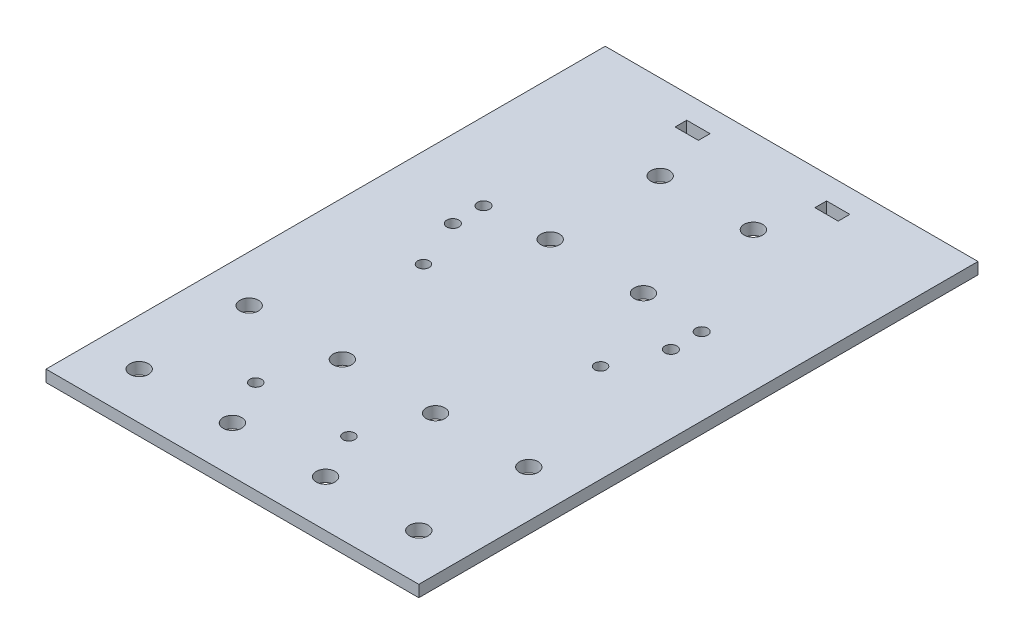
ISO-10303-21;
HEADER;
FILE_DESCRIPTION(('STEP AP214'),'2;1');
FILE_NAME('part.step','',(''),(''),'','','');
FILE_SCHEMA(('AUTOMOTIVE_DESIGN { 1 0 10303 214 1 1 1 1 }'));
ENDSEC;
DATA;
#1=APPLICATION_CONTEXT('core data for automotive mechanical design processes');
#2=APPLICATION_PROTOCOL_DEFINITION('international standard','automotive_design',2000,#1);
#3=PRODUCT_CONTEXT('',#1,'mechanical');
#4=PRODUCT('Part','Part','',(#3));
#5=PRODUCT_RELATED_PRODUCT_CATEGORY('part','',(#4));
#6=PRODUCT_DEFINITION_FORMATION('','',#4);
#7=PRODUCT_DEFINITION_CONTEXT('part definition',#1,'design');
#8=PRODUCT_DEFINITION('design','',#6,#7);
#9=PRODUCT_DEFINITION_SHAPE('','',#8);
#10=(LENGTH_UNIT() NAMED_UNIT(*) SI_UNIT(.MILLI.,.METRE.));
#11=(NAMED_UNIT(*) PLANE_ANGLE_UNIT() SI_UNIT($,.RADIAN.));
#12=(NAMED_UNIT(*) SI_UNIT($,.STERADIAN.) SOLID_ANGLE_UNIT());
#13=UNCERTAINTY_MEASURE_WITH_UNIT(LENGTH_MEASURE(1.E-05),#10,'distance_accuracy_value','');
#14=(GEOMETRIC_REPRESENTATION_CONTEXT(3) GLOBAL_UNCERTAINTY_ASSIGNED_CONTEXT((#13)) GLOBAL_UNIT_ASSIGNED_CONTEXT((#10,
#11,#12)) REPRESENTATION_CONTEXT('',''));
#15=CARTESIAN_POINT('',(0.,0.,0.));
#16=DIRECTION('',(0.,0.,1.));
#17=DIRECTION('',(1.,0.,0.));
#18=AXIS2_PLACEMENT_3D('',#15,#16,#17);
#19=CARTESIAN_POINT('',(50.8,3.175,76.2));
#20=DIRECTION('',(-1.,0.,0.));
#21=DIRECTION('',(0.,0.,1.));
#22=AXIS2_PLACEMENT_3D('',#19,#20,#21);
#23=PLANE('',#22);
#24=DIRECTION('',(0.,0.,-1.));
#25=VECTOR('',#24,1.);
#26=CARTESIAN_POINT('',(50.8,0.,76.2));
#27=LINE('',#26,#25);
#28=CARTESIAN_POINT('',(50.8,0.,76.2));
#29=VERTEX_POINT('',#28);
#30=CARTESIAN_POINT('',(50.8,0.,-76.2));
#31=VERTEX_POINT('',#30);
#32=EDGE_CURVE('E312',#29,#31,#27,.T.);
#33=ORIENTED_EDGE('',*,*,#32,.T.);
#34=DIRECTION('',(0.,-1.,0.));
#35=VECTOR('',#34,1.);
#36=CARTESIAN_POINT('',(50.8,3.175,-76.2));
#37=LINE('',#36,#35);
#38=CARTESIAN_POINT('',(50.8,3.175,-76.2));
#39=VERTEX_POINT('',#38);
#40=EDGE_CURVE('E11',#39,#31,#37,.T.);
#41=ORIENTED_EDGE('',*,*,#40,.F.);
#42=DIRECTION('',(0.,0.,-1.));
#43=VECTOR('',#42,1.);
#44=CARTESIAN_POINT('',(50.8,3.175,76.2));
#45=LINE('',#44,#43);
#46=CARTESIAN_POINT('',(50.8,3.175,76.2));
#47=VERTEX_POINT('',#46);
#48=EDGE_CURVE('E315',#47,#39,#45,.T.);
#49=ORIENTED_EDGE('',*,*,#48,.F.);
#50=DIRECTION('',(0.,-1.,0.));
#51=VECTOR('',#50,1.);
#52=CARTESIAN_POINT('',(50.8,3.175,76.2));
#53=LINE('',#52,#51);
#54=EDGE_CURVE('E325',#47,#29,#53,.T.);
#55=ORIENTED_EDGE('',*,*,#54,.T.);
#56=EDGE_LOOP('',(#33,#41,#49,#55));
#57=FACE_BOUND('',#56,.T.);
#58=ADVANCED_FACE('F37',(#57),#23,.F.);
#59=CARTESIAN_POINT('',(-50.8,3.175,-76.2));
#60=DIRECTION('',(0.,0.,1.));
#61=DIRECTION('',(1.,0.,0.));
#62=AXIS2_PLACEMENT_3D('',#59,#60,#61);
#63=PLANE('',#62);
#64=DIRECTION('',(-1.,0.,0.));
#65=VECTOR('',#64,1.);
#66=CARTESIAN_POINT('',(-50.8,0.,-76.2));
#67=LINE('',#66,#65);
#68=CARTESIAN_POINT('',(-50.8,0.,-76.2));
#69=VERTEX_POINT('',#68);
#70=EDGE_CURVE('E328',#31,#69,#67,.T.);
#71=ORIENTED_EDGE('',*,*,#70,.T.);
#72=DIRECTION('',(0.,-1.,0.));
#73=VECTOR('',#72,1.);
#74=CARTESIAN_POINT('',(-50.8,3.175,-76.2));
#75=LINE('',#74,#73);
#76=CARTESIAN_POINT('',(-50.8,3.175,-76.2));
#77=VERTEX_POINT('',#76);
#78=EDGE_CURVE('E44',#77,#69,#75,.T.);
#79=ORIENTED_EDGE('',*,*,#78,.F.);
#80=DIRECTION('',(-1.,0.,0.));
#81=VECTOR('',#80,1.);
#82=CARTESIAN_POINT('',(-50.8,3.175,-76.2));
#83=LINE('',#82,#81);
#84=EDGE_CURVE('E318',#39,#77,#83,.T.);
#85=ORIENTED_EDGE('',*,*,#84,.F.);
#86=ORIENTED_EDGE('',*,*,#40,.T.);
#87=EDGE_LOOP('',(#71,#79,#85,#86));
#88=FACE_BOUND('',#87,.T.);
#89=ADVANCED_FACE('F357',(#88),#63,.F.);
#90=CARTESIAN_POINT('',(-50.8,3.175,76.2));
#91=DIRECTION('',(1.,0.,0.));
#92=DIRECTION('',(0.,0.,-1.));
#93=AXIS2_PLACEMENT_3D('',#90,#91,#92);
#94=PLANE('',#93);
#95=DIRECTION('',(0.,0.,1.));
#96=VECTOR('',#95,1.);
#97=CARTESIAN_POINT('',(-50.8,0.,76.2));
#98=LINE('',#97,#96);
#99=CARTESIAN_POINT('',(-50.8,0.,76.2));
#100=VERTEX_POINT('',#99);
#101=EDGE_CURVE('E330',#69,#100,#98,.T.);
#102=ORIENTED_EDGE('',*,*,#101,.T.);
#103=DIRECTION('',(0.,-1.,0.));
#104=VECTOR('',#103,1.);
#105=CARTESIAN_POINT('',(-50.8,3.175,76.2));
#106=LINE('',#105,#104);
#107=CARTESIAN_POINT('',(-50.8,3.175,76.2));
#108=VERTEX_POINT('',#107);
#109=EDGE_CURVE('E335',#108,#100,#106,.T.);
#110=ORIENTED_EDGE('',*,*,#109,.F.);
#111=DIRECTION('',(0.,0.,1.));
#112=VECTOR('',#111,1.);
#113=CARTESIAN_POINT('',(-50.8,3.175,76.2));
#114=LINE('',#113,#112);
#115=EDGE_CURVE('E321',#77,#108,#114,.T.);
#116=ORIENTED_EDGE('',*,*,#115,.F.);
#117=ORIENTED_EDGE('',*,*,#78,.T.);
#118=EDGE_LOOP('',(#102,#110,#116,#117));
#119=FACE_BOUND('',#118,.T.);
#120=ADVANCED_FACE('F342',(#119),#94,.F.);
#121=CARTESIAN_POINT('',(-50.8,3.175,76.2));
#122=DIRECTION('',(0.,0.,-1.));
#123=DIRECTION('',(-1.,0.,0.));
#124=AXIS2_PLACEMENT_3D('',#121,#122,#123);
#125=PLANE('',#124);
#126=DIRECTION('',(1.,0.,0.));
#127=VECTOR('',#126,1.);
#128=CARTESIAN_POINT('',(-50.8,0.,76.2));
#129=LINE('',#128,#127);
#130=EDGE_CURVE('E319',#100,#29,#129,.T.);
#131=ORIENTED_EDGE('',*,*,#130,.T.);
#132=ORIENTED_EDGE('',*,*,#54,.F.);
#133=DIRECTION('',(1.,0.,0.));
#134=VECTOR('',#133,1.);
#135=CARTESIAN_POINT('',(-50.8,3.175,76.2));
#136=LINE('',#135,#134);
#137=EDGE_CURVE('E323',#108,#47,#136,.T.);
#138=ORIENTED_EDGE('',*,*,#137,.F.);
#139=ORIENTED_EDGE('',*,*,#109,.T.);
#140=EDGE_LOOP('',(#131,#132,#138,#139));
#141=FACE_BOUND('',#140,.T.);
#142=ADVANCED_FACE('F350',(#141),#125,.F.);
#143=CARTESIAN_POINT('',(0.,3.175,0.));
#144=DIRECTION('',(0.,-1.,0.));
#145=DIRECTION('',(0.,0.,-1.));
#146=AXIS2_PLACEMENT_3D('',#143,#144,#145);
#147=PLANE('',#146);
#148=DIRECTION('',(1.,0.,0.));
#149=VECTOR('',#148,1.);
#150=CARTESIAN_POINT('',(-22.225,3.175,-66.675));
#151=LINE('',#150,#149);
#152=CARTESIAN_POINT('',(-22.225,3.175,-66.675));
#153=VERTEX_POINT('',#152);
#154=CARTESIAN_POINT('',(-15.875,3.175,-66.675));
#155=VERTEX_POINT('',#154);
#156=EDGE_CURVE('E155',#153,#155,#151,.T.);
#157=ORIENTED_EDGE('',*,*,#156,.F.);
#158=DIRECTION('',(0.,0.,1.));
#159=VECTOR('',#158,1.);
#160=CARTESIAN_POINT('',(-22.225,3.175,-69.85));
#161=LINE('',#160,#159);
#162=CARTESIAN_POINT('',(-22.225,3.175,-69.85));
#163=VERTEX_POINT('',#162);
#164=EDGE_CURVE('E51',#163,#153,#161,.T.);
#165=ORIENTED_EDGE('',*,*,#164,.F.);
#166=DIRECTION('',(-1.,0.,0.));
#167=VECTOR('',#166,1.);
#168=CARTESIAN_POINT('',(-22.225,3.175,-69.85));
#169=LINE('',#168,#167);
#170=CARTESIAN_POINT('',(-15.875,3.175,-69.85));
#171=VERTEX_POINT('',#170);
#172=EDGE_CURVE('E146',#171,#163,#169,.T.);
#173=ORIENTED_EDGE('',*,*,#172,.F.);
#174=DIRECTION('',(0.,0.,-1.));
#175=VECTOR('',#174,1.);
#176=CARTESIAN_POINT('',(-15.875,3.175,-69.85));
#177=LINE('',#176,#175);
#178=EDGE_CURVE('E149',#155,#171,#177,.T.);
#179=ORIENTED_EDGE('',*,*,#178,.F.);
#180=EDGE_LOOP('',(#157,#165,#173,#179));
#181=FACE_BOUND('',#180,.T.);
#182=DIRECTION('',(-1.,0.,0.));
#183=VECTOR('',#182,1.);
#184=CARTESIAN_POINT('',(22.225,3.175,-69.85));
#185=LINE('',#184,#183);
#186=CARTESIAN_POINT('',(22.225,3.175,-69.85));
#187=VERTEX_POINT('',#186);
#188=CARTESIAN_POINT('',(15.875,3.175,-69.85));
#189=VERTEX_POINT('',#188);
#190=EDGE_CURVE('E181',#187,#189,#185,.T.);
#191=ORIENTED_EDGE('',*,*,#190,.F.);
#192=DIRECTION('',(0.,0.,-1.));
#193=VECTOR('',#192,1.);
#194=CARTESIAN_POINT('',(22.225,3.175,-69.85));
#195=LINE('',#194,#193);
#196=CARTESIAN_POINT('',(22.225,3.175,-66.675));
#197=VERTEX_POINT('',#196);
#198=EDGE_CURVE('E59',#197,#187,#195,.T.);
#199=ORIENTED_EDGE('',*,*,#198,.F.);
#200=DIRECTION('',(1.,0.,0.));
#201=VECTOR('',#200,1.);
#202=CARTESIAN_POINT('',(22.225,3.175,-66.675));
#203=LINE('',#202,#201);
#204=CARTESIAN_POINT('',(15.875,3.175,-66.675));
#205=VERTEX_POINT('',#204);
#206=EDGE_CURVE('E170',#205,#197,#203,.T.);
#207=ORIENTED_EDGE('',*,*,#206,.F.);
#208=DIRECTION('',(0.,0.,1.));
#209=VECTOR('',#208,1.);
#210=CARTESIAN_POINT('',(15.875,3.175,-69.85));
#211=LINE('',#210,#209);
#212=EDGE_CURVE('E184',#189,#205,#211,.T.);
#213=ORIENTED_EDGE('',*,*,#212,.F.);
#214=EDGE_LOOP('',(#191,#199,#207,#213));
#215=FACE_BOUND('',#214,.T.);
#216=CARTESIAN_POINT('',(-24.13,3.175,0.));
#217=DIRECTION('',(0.,1.,0.));
#218=DIRECTION('',(0.,0.,1.));
#219=AXIS2_PLACEMENT_3D('',#216,#217,#218);
#220=CIRCLE('',#219,1.5875);
#221=CARTESIAN_POINT('',(-24.13,3.175,1.5875));
#222=VERTEX_POINT('',#221);
#223=EDGE_CURVE('E199',#222,#222,#220,.T.);
#224=ORIENTED_EDGE('',*,*,#223,.F.);
#225=EDGE_LOOP('',(#224));
#226=FACE_BOUND('',#225,.T.);
#227=CARTESIAN_POINT('',(6.35000000000002,3.175,50.8));
#228=DIRECTION('',(0.,1.,0.));
#229=DIRECTION('',(0.,0.,1.));
#230=AXIS2_PLACEMENT_3D('',#227,#228,#229);
#231=CIRCLE('',#230,1.5875);
#232=CARTESIAN_POINT('',(6.35000000000002,3.175,52.3875));
#233=VERTEX_POINT('',#232);
#234=EDGE_CURVE('E162',#233,#233,#231,.T.);
#235=ORIENTED_EDGE('',*,*,#234,.F.);
#236=EDGE_LOOP('',(#235));
#237=FACE_BOUND('',#236,.T.);
#238=CARTESIAN_POINT('',(-19.05,3.175,50.8));
#239=DIRECTION('',(0.,1.,0.));
#240=DIRECTION('',(0.,0.,1.));
#241=AXIS2_PLACEMENT_3D('',#238,#239,#240);
#242=CIRCLE('',#241,1.5875);
#243=CARTESIAN_POINT('',(-19.05,3.175,52.3875));
#244=VERTEX_POINT('',#243);
#245=EDGE_CURVE('E206',#244,#244,#242,.T.);
#246=ORIENTED_EDGE('',*,*,#245,.F.);
#247=EDGE_LOOP('',(#246));
#248=FACE_BOUND('',#247,.T.);
#249=CARTESIAN_POINT('',(24.1299999999999,3.175,0.));
#250=DIRECTION('',(0.,1.,0.));
#251=DIRECTION('',(0.,0.,-1.));
#252=AXIS2_PLACEMENT_3D('',#249,#250,#251);
#253=CIRCLE('',#252,1.5875);
#254=CARTESIAN_POINT('',(24.1299999999999,3.175,-1.58750000000005));
#255=VERTEX_POINT('',#254);
#256=EDGE_CURVE('E211',#255,#255,#253,.T.);
#257=ORIENTED_EDGE('',*,*,#256,.F.);
#258=EDGE_LOOP('',(#257));
#259=FACE_BOUND('',#258,.T.);
#260=CARTESIAN_POINT('',(-29.718,3.175,-13.589));
#261=DIRECTION('',(0.,1.,0.));
#262=DIRECTION('',(0.,0.,-1.));
#263=AXIS2_PLACEMENT_3D('',#260,#261,#262);
#264=CIRCLE('',#263,1.65099999999999);
#265=CARTESIAN_POINT('',(-29.718,3.175,-15.24));
#266=VERTEX_POINT('',#265);
#267=EDGE_CURVE('E198',#266,#266,#264,.T.);
#268=ORIENTED_EDGE('',*,*,#267,.F.);
#269=EDGE_LOOP('',(#268));
#270=FACE_BOUND('',#269,.T.);
#271=CARTESIAN_POINT('',(-29.718,3.175,-21.971));
#272=DIRECTION('',(0.,1.,0.));
#273=DIRECTION('',(0.,0.,1.));
#274=AXIS2_PLACEMENT_3D('',#271,#272,#273);
#275=CIRCLE('',#274,1.651);
#276=CARTESIAN_POINT('',(-29.718,3.175,-20.32));
#277=VERTEX_POINT('',#276);
#278=EDGE_CURVE('E229',#277,#277,#275,.T.);
#279=ORIENTED_EDGE('',*,*,#278,.F.);
#280=EDGE_LOOP('',(#279));
#281=FACE_BOUND('',#280,.T.);
#282=CARTESIAN_POINT('',(29.718,3.175,-21.971));
#283=DIRECTION('',(0.,1.,0.));
#284=DIRECTION('',(0.,0.,-1.));
#285=AXIS2_PLACEMENT_3D('',#282,#283,#284);
#286=CIRCLE('',#285,1.651);
#287=CARTESIAN_POINT('',(29.718,3.175,-23.622));
#288=VERTEX_POINT('',#287);
#289=EDGE_CURVE('E223',#288,#288,#286,.T.);
#290=ORIENTED_EDGE('',*,*,#289,.F.);
#291=EDGE_LOOP('',(#290));
#292=FACE_BOUND('',#291,.T.);
#293=CARTESIAN_POINT('',(29.718,3.175,-13.589));
#294=DIRECTION('',(0.,1.,0.));
#295=DIRECTION('',(0.,0.,1.));
#296=AXIS2_PLACEMENT_3D('',#293,#294,#295);
#297=CIRCLE('',#296,1.651);
#298=CARTESIAN_POINT('',(29.718,3.175,-11.938));
#299=VERTEX_POINT('',#298);
#300=EDGE_CURVE('E222',#299,#299,#297,.T.);
#301=ORIENTED_EDGE('',*,*,#300,.F.);
#302=EDGE_LOOP('',(#301));
#303=FACE_BOUND('',#302,.T.);
#304=CARTESIAN_POINT('',(-12.7000000000001,3.175,33.528));
#305=DIRECTION('',(0.,1.,0.));
#306=DIRECTION('',(0.,0.,1.));
#307=AXIS2_PLACEMENT_3D('',#304,#305,#306);
#308=CIRCLE('',#307,2.54);
#309=CARTESIAN_POINT('',(-12.7000000000001,3.175,36.068));
#310=VERTEX_POINT('',#309);
#311=EDGE_CURVE('E277',#310,#310,#308,.T.);
#312=ORIENTED_EDGE('',*,*,#311,.F.);
#313=EDGE_LOOP('',(#312));
#314=FACE_BOUND('',#313,.T.);
#315=CARTESIAN_POINT('',(12.6999999999999,3.175,33.528));
#316=DIRECTION('',(0.,1.,0.));
#317=DIRECTION('',(0.,0.,1.));
#318=AXIS2_PLACEMENT_3D('',#315,#316,#317);
#319=CIRCLE('',#318,2.54);
#320=CARTESIAN_POINT('',(12.6999999999999,3.175,36.068));
#321=VERTEX_POINT('',#320);
#322=EDGE_CURVE('E264',#321,#321,#319,.T.);
#323=ORIENTED_EDGE('',*,*,#322,.F.);
#324=EDGE_LOOP('',(#323));
#325=FACE_BOUND('',#324,.T.);
#326=CARTESIAN_POINT('',(38.0999999999999,3.175,33.528));
#327=DIRECTION('',(0.,1.,0.));
#328=DIRECTION('',(0.,0.,1.));
#329=AXIS2_PLACEMENT_3D('',#326,#327,#328);
#330=CIRCLE('',#329,2.54);
#331=CARTESIAN_POINT('',(38.0999999999999,3.175,36.068));
#332=VERTEX_POINT('',#331);
#333=EDGE_CURVE('E265',#332,#332,#330,.T.);
#334=ORIENTED_EDGE('',*,*,#333,.F.);
#335=EDGE_LOOP('',(#334));
#336=FACE_BOUND('',#335,.T.);
#337=CARTESIAN_POINT('',(-12.7000000000003,3.175,-23.114));
#338=DIRECTION('',(0.,1.,0.));
#339=DIRECTION('',(0.,0.,1.));
#340=AXIS2_PLACEMENT_3D('',#337,#338,#339);
#341=CIRCLE('',#340,2.54);
#342=CARTESIAN_POINT('',(-12.7000000000003,3.175,-20.574));
#343=VERTEX_POINT('',#342);
#344=EDGE_CURVE('E252',#343,#343,#341,.T.);
#345=ORIENTED_EDGE('',*,*,#344,.F.);
#346=EDGE_LOOP('',(#345));
#347=FACE_BOUND('',#346,.T.);
#348=CARTESIAN_POINT('',(-12.7,3.175,63.5));
#349=DIRECTION('',(0.,1.,0.));
#350=DIRECTION('',(0.,0.,1.));
#351=AXIS2_PLACEMENT_3D('',#348,#349,#350);
#352=CIRCLE('',#351,2.54);
#353=CARTESIAN_POINT('',(-12.7,3.175,66.04));
#354=VERTEX_POINT('',#353);
#355=EDGE_CURVE('E301',#354,#354,#352,.T.);
#356=ORIENTED_EDGE('',*,*,#355,.F.);
#357=EDGE_LOOP('',(#356));
#358=FACE_BOUND('',#357,.T.);
#359=CARTESIAN_POINT('',(12.7,3.175,63.5));
#360=DIRECTION('',(0.,1.,0.));
#361=DIRECTION('',(0.,0.,1.));
#362=AXIS2_PLACEMENT_3D('',#359,#360,#361);
#363=CIRCLE('',#362,2.54);
#364=CARTESIAN_POINT('',(12.7,3.175,66.04));
#365=VERTEX_POINT('',#364);
#366=EDGE_CURVE('E288',#365,#365,#363,.T.);
#367=ORIENTED_EDGE('',*,*,#366,.F.);
#368=EDGE_LOOP('',(#367));
#369=FACE_BOUND('',#368,.T.);
#370=CARTESIAN_POINT('',(38.1,3.175,63.5));
#371=DIRECTION('',(0.,1.,0.));
#372=DIRECTION('',(0.,0.,1.));
#373=AXIS2_PLACEMENT_3D('',#370,#371,#372);
#374=CIRCLE('',#373,2.54);
#375=CARTESIAN_POINT('',(38.1,3.175,66.04));
#376=VERTEX_POINT('',#375);
#377=EDGE_CURVE('E289',#376,#376,#374,.T.);
#378=ORIENTED_EDGE('',*,*,#377,.F.);
#379=EDGE_LOOP('',(#378));
#380=FACE_BOUND('',#379,.T.);
#381=CARTESIAN_POINT('',(-38.1000000000001,3.175,33.528));
#382=DIRECTION('',(0.,1.,0.));
#383=DIRECTION('',(0.,0.,1.));
#384=AXIS2_PLACEMENT_3D('',#381,#382,#383);
#385=CIRCLE('',#384,2.54);
#386=CARTESIAN_POINT('',(-38.1000000000001,3.175,36.068));
#387=VERTEX_POINT('',#386);
#388=EDGE_CURVE('E276',#387,#387,#385,.T.);
#389=ORIENTED_EDGE('',*,*,#388,.F.);
#390=EDGE_LOOP('',(#389));
#391=FACE_BOUND('',#390,.T.);
#392=CARTESIAN_POINT('',(12.6999999999996,3.175,-53.086));
#393=DIRECTION('',(0.,1.,0.));
#394=DIRECTION('',(0.,0.,1.));
#395=AXIS2_PLACEMENT_3D('',#392,#393,#394);
#396=CIRCLE('',#395,2.54);
#397=CARTESIAN_POINT('',(12.6999999999996,3.175,-50.546));
#398=VERTEX_POINT('',#397);
#399=EDGE_CURVE('E240',#398,#398,#396,.T.);
#400=ORIENTED_EDGE('',*,*,#399,.F.);
#401=EDGE_LOOP('',(#400));
#402=FACE_BOUND('',#401,.T.);
#403=CARTESIAN_POINT('',(-12.7000000000004,3.175,-53.086));
#404=DIRECTION('',(0.,1.,0.));
#405=DIRECTION('',(0.,0.,1.));
#406=AXIS2_PLACEMENT_3D('',#403,#404,#405);
#407=CIRCLE('',#406,2.54);
#408=CARTESIAN_POINT('',(-12.7000000000004,3.175,-50.546));
#409=VERTEX_POINT('',#408);
#410=EDGE_CURVE('E246',#409,#409,#407,.T.);
#411=ORIENTED_EDGE('',*,*,#410,.F.);
#412=EDGE_LOOP('',(#411));
#413=FACE_BOUND('',#412,.T.);
#414=CARTESIAN_POINT('',(12.6999999999997,3.175,-23.114));
#415=DIRECTION('',(0.,1.,0.));
#416=DIRECTION('',(0.,0.,1.));
#417=AXIS2_PLACEMENT_3D('',#414,#415,#416);
#418=CIRCLE('',#417,2.54);
#419=CARTESIAN_POINT('',(12.6999999999997,3.175,-20.574));
#420=VERTEX_POINT('',#419);
#421=EDGE_CURVE('E253',#420,#420,#418,.T.);
#422=ORIENTED_EDGE('',*,*,#421,.F.);
#423=EDGE_LOOP('',(#422));
#424=FACE_BOUND('',#423,.T.);
#425=CARTESIAN_POINT('',(-38.1,3.175,63.5));
#426=DIRECTION('',(0.,1.,0.));
#427=DIRECTION('',(0.,0.,1.));
#428=AXIS2_PLACEMENT_3D('',#425,#426,#427);
#429=CIRCLE('',#428,2.54);
#430=CARTESIAN_POINT('',(-38.1,3.175,66.04));
#431=VERTEX_POINT('',#430);
#432=EDGE_CURVE('E300',#431,#431,#429,.T.);
#433=ORIENTED_EDGE('',*,*,#432,.F.);
#434=EDGE_LOOP('',(#433));
#435=FACE_BOUND('',#434,.T.);
#436=ORIENTED_EDGE('',*,*,#48,.T.);
#437=ORIENTED_EDGE('',*,*,#84,.T.);
#438=ORIENTED_EDGE('',*,*,#115,.T.);
#439=ORIENTED_EDGE('',*,*,#137,.T.);
#440=EDGE_LOOP('',(#436,#437,#438,#439));
#441=FACE_BOUND('',#440,.T.);
#442=ADVANCED_FACE('F356',(#181,#215,#226,#237,#248,#259,#270,#281,#292,#303,#314,#325,#336,
#347,#358,#369,#380,#391,#402,#413,#424,#435,#441),#147,.F.);
#443=CARTESIAN_POINT('',(0.,0.,0.));
#444=DIRECTION('',(0.,-1.,0.));
#445=DIRECTION('',(0.,0.,-1.));
#446=AXIS2_PLACEMENT_3D('',#443,#444,#445);
#447=PLANE('',#446);
#448=DIRECTION('',(0.,0.,1.));
#449=VECTOR('',#448,1.);
#450=CARTESIAN_POINT('',(-22.225,0.,-69.85));
#451=LINE('',#450,#449);
#452=CARTESIAN_POINT('',(-22.225,0.,-69.85));
#453=VERTEX_POINT('',#452);
#454=CARTESIAN_POINT('',(-22.225,0.,-66.675));
#455=VERTEX_POINT('',#454);
#456=EDGE_CURVE('E127',#453,#455,#451,.T.);
#457=ORIENTED_EDGE('',*,*,#456,.T.);
#458=DIRECTION('',(1.,0.,0.));
#459=VECTOR('',#458,1.);
#460=CARTESIAN_POINT('',(-22.225,0.,-66.675));
#461=LINE('',#460,#459);
#462=CARTESIAN_POINT('',(-15.875,0.,-66.675));
#463=VERTEX_POINT('',#462);
#464=EDGE_CURVE('E137',#455,#463,#461,.T.);
#465=ORIENTED_EDGE('',*,*,#464,.T.);
#466=DIRECTION('',(0.,0.,-1.));
#467=VECTOR('',#466,1.);
#468=CARTESIAN_POINT('',(-15.875,0.,-69.85));
#469=LINE('',#468,#467);
#470=CARTESIAN_POINT('',(-15.875,0.,-69.85));
#471=VERTEX_POINT('',#470);
#472=EDGE_CURVE('E141',#463,#471,#469,.T.);
#473=ORIENTED_EDGE('',*,*,#472,.T.);
#474=DIRECTION('',(-1.,0.,0.));
#475=VECTOR('',#474,1.);
#476=CARTESIAN_POINT('',(-22.225,0.,-69.85));
#477=LINE('',#476,#475);
#478=EDGE_CURVE('E133',#471,#453,#477,.T.);
#479=ORIENTED_EDGE('',*,*,#478,.T.);
#480=EDGE_LOOP('',(#457,#465,#473,#479));
#481=FACE_BOUND('',#480,.T.);
#482=DIRECTION('',(0.,0.,-1.));
#483=VECTOR('',#482,1.);
#484=CARTESIAN_POINT('',(22.225,0.,-69.85));
#485=LINE('',#484,#483);
#486=CARTESIAN_POINT('',(22.225,0.,-66.675));
#487=VERTEX_POINT('',#486);
#488=CARTESIAN_POINT('',(22.225,0.,-69.85));
#489=VERTEX_POINT('',#488);
#490=EDGE_CURVE('E166',#487,#489,#485,.T.);
#491=ORIENTED_EDGE('',*,*,#490,.T.);
#492=DIRECTION('',(-1.,0.,0.));
#493=VECTOR('',#492,1.);
#494=CARTESIAN_POINT('',(22.225,0.,-69.85));
#495=LINE('',#494,#493);
#496=CARTESIAN_POINT('',(15.875,0.,-69.85));
#497=VERTEX_POINT('',#496);
#498=EDGE_CURVE('E169',#489,#497,#495,.T.);
#499=ORIENTED_EDGE('',*,*,#498,.T.);
#500=DIRECTION('',(0.,0.,1.));
#501=VECTOR('',#500,1.);
#502=CARTESIAN_POINT('',(15.875,0.,-69.85));
#503=LINE('',#502,#501);
#504=CARTESIAN_POINT('',(15.875,0.,-66.675));
#505=VERTEX_POINT('',#504);
#506=EDGE_CURVE('E173',#497,#505,#503,.T.);
#507=ORIENTED_EDGE('',*,*,#506,.T.);
#508=DIRECTION('',(1.,0.,0.));
#509=VECTOR('',#508,1.);
#510=CARTESIAN_POINT('',(22.225,0.,-66.675));
#511=LINE('',#510,#509);
#512=EDGE_CURVE('E176',#505,#487,#511,.T.);
#513=ORIENTED_EDGE('',*,*,#512,.T.);
#514=EDGE_LOOP('',(#491,#499,#507,#513));
#515=FACE_BOUND('',#514,.T.);
#516=CARTESIAN_POINT('',(-24.13,0.,0.));
#517=DIRECTION('',(0.,1.,0.));
#518=DIRECTION('',(0.,0.,1.));
#519=AXIS2_PLACEMENT_3D('',#516,#517,#518);
#520=CIRCLE('',#519,1.5875);
#521=CARTESIAN_POINT('',(-24.13,0.,1.5875));
#522=VERTEX_POINT('',#521);
#523=EDGE_CURVE('E195',#522,#522,#520,.T.);
#524=ORIENTED_EDGE('',*,*,#523,.T.);
#525=EDGE_LOOP('',(#524));
#526=FACE_BOUND('',#525,.T.);
#527=CARTESIAN_POINT('',(6.35000000000002,0.,50.8));
#528=DIRECTION('',(0.,1.,0.));
#529=DIRECTION('',(0.,0.,1.));
#530=AXIS2_PLACEMENT_3D('',#527,#528,#529);
#531=CIRCLE('',#530,1.5875);
#532=CARTESIAN_POINT('',(6.35000000000002,0.,52.3875));
#533=VERTEX_POINT('',#532);
#534=EDGE_CURVE('E203',#533,#533,#531,.T.);
#535=ORIENTED_EDGE('',*,*,#534,.T.);
#536=EDGE_LOOP('',(#535));
#537=FACE_BOUND('',#536,.T.);
#538=CARTESIAN_POINT('',(-19.05,0.,50.8));
#539=DIRECTION('',(0.,1.,0.));
#540=DIRECTION('',(0.,0.,1.));
#541=AXIS2_PLACEMENT_3D('',#538,#539,#540);
#542=CIRCLE('',#541,1.5875);
#543=CARTESIAN_POINT('',(-19.05,0.,52.3875));
#544=VERTEX_POINT('',#543);
#545=EDGE_CURVE('E214',#544,#544,#542,.T.);
#546=ORIENTED_EDGE('',*,*,#545,.T.);
#547=EDGE_LOOP('',(#546));
#548=FACE_BOUND('',#547,.T.);
#549=CARTESIAN_POINT('',(24.1299999999999,0.,0.));
#550=DIRECTION('',(0.,1.,0.));
#551=DIRECTION('',(0.,0.,-1.));
#552=AXIS2_PLACEMENT_3D('',#549,#550,#551);
#553=CIRCLE('',#552,1.5875);
#554=CARTESIAN_POINT('',(24.1299999999999,0.,-1.58750000000005));
#555=VERTEX_POINT('',#554);
#556=EDGE_CURVE('E202',#555,#555,#553,.T.);
#557=ORIENTED_EDGE('',*,*,#556,.T.);
#558=EDGE_LOOP('',(#557));
#559=FACE_BOUND('',#558,.T.);
#560=CARTESIAN_POINT('',(-29.718,0.,-13.589));
#561=DIRECTION('',(0.,1.,0.));
#562=DIRECTION('',(0.,0.,-1.));
#563=AXIS2_PLACEMENT_3D('',#560,#561,#562);
#564=CIRCLE('',#563,1.65099999999999);
#565=CARTESIAN_POINT('',(-29.718,0.,-15.24));
#566=VERTEX_POINT('',#565);
#567=EDGE_CURVE('E232',#566,#566,#564,.T.);
#568=ORIENTED_EDGE('',*,*,#567,.T.);
#569=EDGE_LOOP('',(#568));
#570=FACE_BOUND('',#569,.T.);
#571=CARTESIAN_POINT('',(-29.718,0.,-21.971));
#572=DIRECTION('',(0.,1.,0.));
#573=DIRECTION('',(0.,0.,1.));
#574=AXIS2_PLACEMENT_3D('',#571,#572,#573);
#575=CIRCLE('',#574,1.651);
#576=CARTESIAN_POINT('',(-29.718,0.,-20.32));
#577=VERTEX_POINT('',#576);
#578=EDGE_CURVE('E226',#577,#577,#575,.T.);
#579=ORIENTED_EDGE('',*,*,#578,.T.);
#580=EDGE_LOOP('',(#579));
#581=FACE_BOUND('',#580,.T.);
#582=CARTESIAN_POINT('',(29.718,0.,-21.971));
#583=DIRECTION('',(0.,1.,0.));
#584=DIRECTION('',(0.,0.,-1.));
#585=AXIS2_PLACEMENT_3D('',#582,#583,#584);
#586=CIRCLE('',#585,1.651);
#587=CARTESIAN_POINT('',(29.718,0.,-23.622));
#588=VERTEX_POINT('',#587);
#589=EDGE_CURVE('E219',#588,#588,#586,.T.);
#590=ORIENTED_EDGE('',*,*,#589,.T.);
#591=EDGE_LOOP('',(#590));
#592=FACE_BOUND('',#591,.T.);
#593=CARTESIAN_POINT('',(29.718,0.,-13.589));
#594=DIRECTION('',(0.,1.,0.));
#595=DIRECTION('',(0.,0.,1.));
#596=AXIS2_PLACEMENT_3D('',#593,#594,#595);
#597=CIRCLE('',#596,1.651);
#598=CARTESIAN_POINT('',(29.718,0.,-11.938));
#599=VERTEX_POINT('',#598);
#600=EDGE_CURVE('E237',#599,#599,#597,.T.);
#601=ORIENTED_EDGE('',*,*,#600,.T.);
#602=EDGE_LOOP('',(#601));
#603=FACE_BOUND('',#602,.T.);
#604=CARTESIAN_POINT('',(-12.7000000000001,0.,33.528));
#605=DIRECTION('',(0.,1.,0.));
#606=DIRECTION('',(0.,0.,1.));
#607=AXIS2_PLACEMENT_3D('',#604,#605,#606);
#608=CIRCLE('',#607,2.54);
#609=CARTESIAN_POINT('',(-12.7000000000001,0.,36.068));
#610=VERTEX_POINT('',#609);
#611=EDGE_CURVE('E273',#610,#610,#608,.T.);
#612=ORIENTED_EDGE('',*,*,#611,.T.);
#613=EDGE_LOOP('',(#612));
#614=FACE_BOUND('',#613,.T.);
#615=CARTESIAN_POINT('',(12.6999999999999,0.,33.528));
#616=DIRECTION('',(0.,1.,0.));
#617=DIRECTION('',(0.,0.,1.));
#618=AXIS2_PLACEMENT_3D('',#615,#616,#617);
#619=CIRCLE('',#618,2.54);
#620=CARTESIAN_POINT('',(12.6999999999999,0.,36.068));
#621=VERTEX_POINT('',#620);
#622=EDGE_CURVE('E280',#621,#621,#619,.T.);
#623=ORIENTED_EDGE('',*,*,#622,.T.);
#624=EDGE_LOOP('',(#623));
#625=FACE_BOUND('',#624,.T.);
#626=CARTESIAN_POINT('',(38.0999999999999,0.,33.528));
#627=DIRECTION('',(0.,1.,0.));
#628=DIRECTION('',(0.,0.,1.));
#629=AXIS2_PLACEMENT_3D('',#626,#627,#628);
#630=CIRCLE('',#629,2.54);
#631=CARTESIAN_POINT('',(38.0999999999999,0.,36.068));
#632=VERTEX_POINT('',#631);
#633=EDGE_CURVE('E261',#632,#632,#630,.T.);
#634=ORIENTED_EDGE('',*,*,#633,.T.);
#635=EDGE_LOOP('',(#634));
#636=FACE_BOUND('',#635,.T.);
#637=CARTESIAN_POINT('',(-12.7000000000003,0.,-23.114));
#638=DIRECTION('',(0.,1.,0.));
#639=DIRECTION('',(0.,0.,1.));
#640=AXIS2_PLACEMENT_3D('',#637,#638,#639);
#641=CIRCLE('',#640,2.54);
#642=CARTESIAN_POINT('',(-12.7000000000003,0.,-20.574));
#643=VERTEX_POINT('',#642);
#644=EDGE_CURVE('E268',#643,#643,#641,.T.);
#645=ORIENTED_EDGE('',*,*,#644,.T.);
#646=EDGE_LOOP('',(#645));
#647=FACE_BOUND('',#646,.T.);
#648=CARTESIAN_POINT('',(-12.7,0.,63.5));
#649=DIRECTION('',(0.,1.,0.));
#650=DIRECTION('',(0.,0.,1.));
#651=AXIS2_PLACEMENT_3D('',#648,#649,#650);
#652=CIRCLE('',#651,2.54);
#653=CARTESIAN_POINT('',(-12.7,0.,66.04));
#654=VERTEX_POINT('',#653);
#655=EDGE_CURVE('E297',#654,#654,#652,.T.);
#656=ORIENTED_EDGE('',*,*,#655,.T.);
#657=EDGE_LOOP('',(#656));
#658=FACE_BOUND('',#657,.T.);
#659=CARTESIAN_POINT('',(12.7,0.,63.5));
#660=DIRECTION('',(0.,1.,0.));
#661=DIRECTION('',(0.,0.,1.));
#662=AXIS2_PLACEMENT_3D('',#659,#660,#661);
#663=CIRCLE('',#662,2.54);
#664=CARTESIAN_POINT('',(12.7,0.,66.04));
#665=VERTEX_POINT('',#664);
#666=EDGE_CURVE('E304',#665,#665,#663,.T.);
#667=ORIENTED_EDGE('',*,*,#666,.T.);
#668=EDGE_LOOP('',(#667));
#669=FACE_BOUND('',#668,.T.);
#670=CARTESIAN_POINT('',(38.1,0.,63.5));
#671=DIRECTION('',(0.,1.,0.));
#672=DIRECTION('',(0.,0.,1.));
#673=AXIS2_PLACEMENT_3D('',#670,#671,#672);
#674=CIRCLE('',#673,2.54);
#675=CARTESIAN_POINT('',(38.1,0.,66.04));
#676=VERTEX_POINT('',#675);
#677=EDGE_CURVE('E285',#676,#676,#674,.T.);
#678=ORIENTED_EDGE('',*,*,#677,.T.);
#679=EDGE_LOOP('',(#678));
#680=FACE_BOUND('',#679,.T.);
#681=CARTESIAN_POINT('',(-38.1000000000001,0.,33.528));
#682=DIRECTION('',(0.,1.,0.));
#683=DIRECTION('',(0.,0.,1.));
#684=AXIS2_PLACEMENT_3D('',#681,#682,#683);
#685=CIRCLE('',#684,2.54);
#686=CARTESIAN_POINT('',(-38.1000000000001,0.,36.068));
#687=VERTEX_POINT('',#686);
#688=EDGE_CURVE('E292',#687,#687,#685,.T.);
#689=ORIENTED_EDGE('',*,*,#688,.T.);
#690=EDGE_LOOP('',(#689));
#691=FACE_BOUND('',#690,.T.);
#692=CARTESIAN_POINT('',(12.6999999999996,0.,-53.086));
#693=DIRECTION('',(0.,1.,0.));
#694=DIRECTION('',(0.,0.,1.));
#695=AXIS2_PLACEMENT_3D('',#692,#693,#694);
#696=CIRCLE('',#695,2.54);
#697=CARTESIAN_POINT('',(12.6999999999996,0.,-50.546));
#698=VERTEX_POINT('',#697);
#699=EDGE_CURVE('E243',#698,#698,#696,.T.);
#700=ORIENTED_EDGE('',*,*,#699,.T.);
#701=EDGE_LOOP('',(#700));
#702=FACE_BOUND('',#701,.T.);
#703=CARTESIAN_POINT('',(-12.7000000000004,0.,-53.086));
#704=DIRECTION('',(0.,1.,0.));
#705=DIRECTION('',(0.,0.,1.));
#706=AXIS2_PLACEMENT_3D('',#703,#704,#705);
#707=CIRCLE('',#706,2.54);
#708=CARTESIAN_POINT('',(-12.7000000000004,0.,-50.546));
#709=VERTEX_POINT('',#708);
#710=EDGE_CURVE('E256',#709,#709,#707,.T.);
#711=ORIENTED_EDGE('',*,*,#710,.T.);
#712=EDGE_LOOP('',(#711));
#713=FACE_BOUND('',#712,.T.);
#714=CARTESIAN_POINT('',(12.6999999999997,0.,-23.114));
#715=DIRECTION('',(0.,1.,0.));
#716=DIRECTION('',(0.,0.,1.));
#717=AXIS2_PLACEMENT_3D('',#714,#715,#716);
#718=CIRCLE('',#717,2.54);
#719=CARTESIAN_POINT('',(12.6999999999997,0.,-20.574));
#720=VERTEX_POINT('',#719);
#721=EDGE_CURVE('E249',#720,#720,#718,.T.);
#722=ORIENTED_EDGE('',*,*,#721,.T.);
#723=EDGE_LOOP('',(#722));
#724=FACE_BOUND('',#723,.T.);
#725=CARTESIAN_POINT('',(-38.1,0.,63.5));
#726=DIRECTION('',(0.,1.,0.));
#727=DIRECTION('',(0.,0.,1.));
#728=AXIS2_PLACEMENT_3D('',#725,#726,#727);
#729=CIRCLE('',#728,2.54);
#730=CARTESIAN_POINT('',(-38.1,0.,66.04));
#731=VERTEX_POINT('',#730);
#732=EDGE_CURVE('E309',#731,#731,#729,.T.);
#733=ORIENTED_EDGE('',*,*,#732,.T.);
#734=EDGE_LOOP('',(#733));
#735=FACE_BOUND('',#734,.T.);
#736=ORIENTED_EDGE('',*,*,#32,.F.);
#737=ORIENTED_EDGE('',*,*,#130,.F.);
#738=ORIENTED_EDGE('',*,*,#101,.F.);
#739=ORIENTED_EDGE('',*,*,#70,.F.);
#740=EDGE_LOOP('',(#736,#737,#738,#739));
#741=FACE_BOUND('',#740,.T.);
#742=ADVANCED_FACE('F143',(#481,#515,#526,#537,#548,#559,#570,#581,#592,#603,#614,#625,#636,
#647,#658,#669,#680,#691,#702,#713,#724,#735,#741),#447,.T.);
#743=CARTESIAN_POINT('',(-38.1,0.,63.5));
#744=DIRECTION('',(0.,1.,0.));
#745=DIRECTION('',(0.,0.,1.));
#746=AXIS2_PLACEMENT_3D('',#743,#744,#745);
#747=CYLINDRICAL_SURFACE('',#746,2.54);
#748=ORIENTED_EDGE('',*,*,#732,.F.);
#749=EDGE_LOOP('',(#748));
#750=FACE_BOUND('',#749,.T.);
#751=ORIENTED_EDGE('',*,*,#432,.T.);
#752=EDGE_LOOP('',(#751));
#753=FACE_BOUND('',#752,.T.);
#754=ADVANCED_FACE('F369',(#750,#753),#747,.F.);
#755=CARTESIAN_POINT('',(12.6999999999997,0.,-23.114));
#756=DIRECTION('',(0.,1.,0.));
#757=DIRECTION('',(0.,0.,1.));
#758=AXIS2_PLACEMENT_3D('',#755,#756,#757);
#759=CYLINDRICAL_SURFACE('',#758,2.54);
#760=ORIENTED_EDGE('',*,*,#721,.F.);
#761=EDGE_LOOP('',(#760));
#762=FACE_BOUND('',#761,.T.);
#763=ORIENTED_EDGE('',*,*,#421,.T.);
#764=EDGE_LOOP('',(#763));
#765=FACE_BOUND('',#764,.T.);
#766=ADVANCED_FACE('F375',(#762,#765),#759,.F.);
#767=CARTESIAN_POINT('',(-12.7000000000004,0.,-53.086));
#768=DIRECTION('',(0.,1.,0.));
#769=DIRECTION('',(0.,0.,1.));
#770=AXIS2_PLACEMENT_3D('',#767,#768,#769);
#771=CYLINDRICAL_SURFACE('',#770,2.54);
#772=ORIENTED_EDGE('',*,*,#710,.F.);
#773=EDGE_LOOP('',(#772));
#774=FACE_BOUND('',#773,.T.);
#775=ORIENTED_EDGE('',*,*,#410,.T.);
#776=EDGE_LOOP('',(#775));
#777=FACE_BOUND('',#776,.T.);
#778=ADVANCED_FACE('F411',(#774,#777),#771,.F.);
#779=CARTESIAN_POINT('',(12.6999999999996,0.,-53.086));
#780=DIRECTION('',(0.,1.,0.));
#781=DIRECTION('',(0.,0.,1.));
#782=AXIS2_PLACEMENT_3D('',#779,#780,#781);
#783=CYLINDRICAL_SURFACE('',#782,2.54);
#784=ORIENTED_EDGE('',*,*,#699,.F.);
#785=EDGE_LOOP('',(#784));
#786=FACE_BOUND('',#785,.T.);
#787=ORIENTED_EDGE('',*,*,#399,.T.);
#788=EDGE_LOOP('',(#787));
#789=FACE_BOUND('',#788,.T.);
#790=ADVANCED_FACE('F390',(#786,#789),#783,.F.);
#791=CARTESIAN_POINT('',(-38.1000000000001,0.,33.528));
#792=DIRECTION('',(0.,1.,0.));
#793=DIRECTION('',(0.,0.,1.));
#794=AXIS2_PLACEMENT_3D('',#791,#792,#793);
#795=CYLINDRICAL_SURFACE('',#794,2.54);
#796=ORIENTED_EDGE('',*,*,#688,.F.);
#797=EDGE_LOOP('',(#796));
#798=FACE_BOUND('',#797,.T.);
#799=ORIENTED_EDGE('',*,*,#388,.T.);
#800=EDGE_LOOP('',(#799));
#801=FACE_BOUND('',#800,.T.);
#802=ADVANCED_FACE('F387',(#798,#801),#795,.F.);
#803=CARTESIAN_POINT('',(38.1,0.,63.5));
#804=DIRECTION('',(0.,1.,0.));
#805=DIRECTION('',(0.,0.,1.));
#806=AXIS2_PLACEMENT_3D('',#803,#804,#805);
#807=CYLINDRICAL_SURFACE('',#806,2.54);
#808=ORIENTED_EDGE('',*,*,#677,.F.);
#809=EDGE_LOOP('',(#808));
#810=FACE_BOUND('',#809,.T.);
#811=ORIENTED_EDGE('',*,*,#377,.T.);
#812=EDGE_LOOP('',(#811));
#813=FACE_BOUND('',#812,.T.);
#814=ADVANCED_FACE('F381',(#810,#813),#807,.F.);
#815=CARTESIAN_POINT('',(12.7,0.,63.5));
#816=DIRECTION('',(0.,1.,0.));
#817=DIRECTION('',(0.,0.,1.));
#818=AXIS2_PLACEMENT_3D('',#815,#816,#817);
#819=CYLINDRICAL_SURFACE('',#818,2.54);
#820=ORIENTED_EDGE('',*,*,#666,.F.);
#821=EDGE_LOOP('',(#820));
#822=FACE_BOUND('',#821,.T.);
#823=ORIENTED_EDGE('',*,*,#366,.T.);
#824=EDGE_LOOP('',(#823));
#825=FACE_BOUND('',#824,.T.);
#826=ADVANCED_FACE('F377',(#822,#825),#819,.F.);
#827=CARTESIAN_POINT('',(-12.7,0.,63.5));
#828=DIRECTION('',(0.,1.,0.));
#829=DIRECTION('',(0.,0.,1.));
#830=AXIS2_PLACEMENT_3D('',#827,#828,#829);
#831=CYLINDRICAL_SURFACE('',#830,2.54);
#832=ORIENTED_EDGE('',*,*,#655,.F.);
#833=EDGE_LOOP('',(#832));
#834=FACE_BOUND('',#833,.T.);
#835=ORIENTED_EDGE('',*,*,#355,.T.);
#836=EDGE_LOOP('',(#835));
#837=FACE_BOUND('',#836,.T.);
#838=ADVANCED_FACE('F380',(#834,#837),#831,.F.);
#839=CARTESIAN_POINT('',(-12.7000000000003,0.,-23.114));
#840=DIRECTION('',(0.,1.,0.));
#841=DIRECTION('',(0.,0.,1.));
#842=AXIS2_PLACEMENT_3D('',#839,#840,#841);
#843=CYLINDRICAL_SURFACE('',#842,2.54);
#844=ORIENTED_EDGE('',*,*,#644,.F.);
#845=EDGE_LOOP('',(#844));
#846=FACE_BOUND('',#845,.T.);
#847=ORIENTED_EDGE('',*,*,#344,.T.);
#848=EDGE_LOOP('',(#847));
#849=FACE_BOUND('',#848,.T.);
#850=ADVANCED_FACE('F385',(#846,#849),#843,.F.);
#851=CARTESIAN_POINT('',(38.0999999999999,0.,33.528));
#852=DIRECTION('',(0.,1.,0.));
#853=DIRECTION('',(0.,0.,1.));
#854=AXIS2_PLACEMENT_3D('',#851,#852,#853);
#855=CYLINDRICAL_SURFACE('',#854,2.54);
#856=ORIENTED_EDGE('',*,*,#633,.F.);
#857=EDGE_LOOP('',(#856));
#858=FACE_BOUND('',#857,.T.);
#859=ORIENTED_EDGE('',*,*,#333,.T.);
#860=EDGE_LOOP('',(#859));
#861=FACE_BOUND('',#860,.T.);
#862=ADVANCED_FACE('F399',(#858,#861),#855,.F.);
#863=CARTESIAN_POINT('',(12.6999999999999,0.,33.528));
#864=DIRECTION('',(0.,1.,0.));
#865=DIRECTION('',(0.,0.,1.));
#866=AXIS2_PLACEMENT_3D('',#863,#864,#865);
#867=CYLINDRICAL_SURFACE('',#866,2.54);
#868=ORIENTED_EDGE('',*,*,#622,.F.);
#869=EDGE_LOOP('',(#868));
#870=FACE_BOUND('',#869,.T.);
#871=ORIENTED_EDGE('',*,*,#322,.T.);
#872=EDGE_LOOP('',(#871));
#873=FACE_BOUND('',#872,.T.);
#874=ADVANCED_FACE('F395',(#870,#873),#867,.F.);
#875=CARTESIAN_POINT('',(-12.7000000000001,0.,33.528));
#876=DIRECTION('',(0.,1.,0.));
#877=DIRECTION('',(0.,0.,1.));
#878=AXIS2_PLACEMENT_3D('',#875,#876,#877);
#879=CYLINDRICAL_SURFACE('',#878,2.54);
#880=ORIENTED_EDGE('',*,*,#611,.F.);
#881=EDGE_LOOP('',(#880));
#882=FACE_BOUND('',#881,.T.);
#883=ORIENTED_EDGE('',*,*,#311,.T.);
#884=EDGE_LOOP('',(#883));
#885=FACE_BOUND('',#884,.T.);
#886=ADVANCED_FACE('F398',(#882,#885),#879,.F.);
#887=CARTESIAN_POINT('',(29.718,0.,-13.589));
#888=DIRECTION('',(0.,1.,0.));
#889=DIRECTION('',(0.,0.,1.));
#890=AXIS2_PLACEMENT_3D('',#887,#888,#889);
#891=CYLINDRICAL_SURFACE('',#890,1.651);
#892=ORIENTED_EDGE('',*,*,#600,.F.);
#893=EDGE_LOOP('',(#892));
#894=FACE_BOUND('',#893,.T.);
#895=ORIENTED_EDGE('',*,*,#300,.T.);
#896=EDGE_LOOP('',(#895));
#897=FACE_BOUND('',#896,.T.);
#898=ADVANCED_FACE('F403',(#894,#897),#891,.F.);
#899=CARTESIAN_POINT('',(29.718,0.,-21.971));
#900=DIRECTION('',(0.,1.,0.));
#901=DIRECTION('',(0.,0.,1.));
#902=AXIS2_PLACEMENT_3D('',#899,#900,#901);
#903=CYLINDRICAL_SURFACE('',#902,1.651);
#904=ORIENTED_EDGE('',*,*,#589,.F.);
#905=EDGE_LOOP('',(#904));
#906=FACE_BOUND('',#905,.T.);
#907=ORIENTED_EDGE('',*,*,#289,.T.);
#908=EDGE_LOOP('',(#907));
#909=FACE_BOUND('',#908,.T.);
#910=ADVANCED_FACE('F423',(#906,#909),#903,.F.);
#911=CARTESIAN_POINT('',(-29.718,0.,-21.971));
#912=DIRECTION('',(0.,1.,0.));
#913=DIRECTION('',(0.,0.,1.));
#914=AXIS2_PLACEMENT_3D('',#911,#912,#913);
#915=CYLINDRICAL_SURFACE('',#914,1.651);
#916=ORIENTED_EDGE('',*,*,#578,.F.);
#917=EDGE_LOOP('',(#916));
#918=FACE_BOUND('',#917,.T.);
#919=ORIENTED_EDGE('',*,*,#278,.T.);
#920=EDGE_LOOP('',(#919));
#921=FACE_BOUND('',#920,.T.);
#922=ADVANCED_FACE('F429',(#918,#921),#915,.F.);
#923=CARTESIAN_POINT('',(-29.718,0.,-13.589));
#924=DIRECTION('',(0.,1.,0.));
#925=DIRECTION('',(0.,0.,1.));
#926=AXIS2_PLACEMENT_3D('',#923,#924,#925);
#927=CYLINDRICAL_SURFACE('',#926,1.65099999999999);
#928=ORIENTED_EDGE('',*,*,#567,.F.);
#929=EDGE_LOOP('',(#928));
#930=FACE_BOUND('',#929,.T.);
#931=ORIENTED_EDGE('',*,*,#267,.T.);
#932=EDGE_LOOP('',(#931));
#933=FACE_BOUND('',#932,.T.);
#934=ADVANCED_FACE('F425',(#930,#933),#927,.F.);
#935=CARTESIAN_POINT('',(24.1299999999999,0.,0.));
#936=DIRECTION('',(0.,1.,0.));
#937=DIRECTION('',(0.,0.,1.));
#938=AXIS2_PLACEMENT_3D('',#935,#936,#937);
#939=CYLINDRICAL_SURFACE('',#938,1.5875);
#940=ORIENTED_EDGE('',*,*,#556,.F.);
#941=EDGE_LOOP('',(#940));
#942=FACE_BOUND('',#941,.T.);
#943=ORIENTED_EDGE('',*,*,#256,.T.);
#944=EDGE_LOOP('',(#943));
#945=FACE_BOUND('',#944,.T.);
#946=ADVANCED_FACE('F428',(#942,#945),#939,.F.);
#947=CARTESIAN_POINT('',(-19.05,0.,50.8));
#948=DIRECTION('',(0.,1.,0.));
#949=DIRECTION('',(0.,0.,1.));
#950=AXIS2_PLACEMENT_3D('',#947,#948,#949);
#951=CYLINDRICAL_SURFACE('',#950,1.5875);
#952=ORIENTED_EDGE('',*,*,#545,.F.);
#953=EDGE_LOOP('',(#952));
#954=FACE_BOUND('',#953,.T.);
#955=ORIENTED_EDGE('',*,*,#245,.T.);
#956=EDGE_LOOP('',(#955));
#957=FACE_BOUND('',#956,.T.);
#958=ADVANCED_FACE('F437',(#954,#957),#951,.F.);
#959=CARTESIAN_POINT('',(6.35000000000002,0.,50.8));
#960=DIRECTION('',(0.,1.,0.));
#961=DIRECTION('',(0.,0.,1.));
#962=AXIS2_PLACEMENT_3D('',#959,#960,#961);
#963=CYLINDRICAL_SURFACE('',#962,1.5875);
#964=ORIENTED_EDGE('',*,*,#534,.F.);
#965=EDGE_LOOP('',(#964));
#966=FACE_BOUND('',#965,.T.);
#967=ORIENTED_EDGE('',*,*,#234,.T.);
#968=EDGE_LOOP('',(#967));
#969=FACE_BOUND('',#968,.T.);
#970=ADVANCED_FACE('F440',(#966,#969),#963,.F.);
#971=CARTESIAN_POINT('',(-24.13,0.,0.));
#972=DIRECTION('',(0.,1.,0.));
#973=DIRECTION('',(0.,0.,1.));
#974=AXIS2_PLACEMENT_3D('',#971,#972,#973);
#975=CYLINDRICAL_SURFACE('',#974,1.5875);
#976=ORIENTED_EDGE('',*,*,#523,.F.);
#977=EDGE_LOOP('',(#976));
#978=FACE_BOUND('',#977,.T.);
#979=ORIENTED_EDGE('',*,*,#223,.T.);
#980=EDGE_LOOP('',(#979));
#981=FACE_BOUND('',#980,.T.);
#982=ADVANCED_FACE('F447',(#978,#981),#975,.F.);
#983=CARTESIAN_POINT('',(22.225,0.,-69.85));
#984=DIRECTION('',(1.,0.,0.));
#985=DIRECTION('',(0.,0.,-1.));
#986=AXIS2_PLACEMENT_3D('',#983,#984,#985);
#987=PLANE('',#986);
#988=ORIENTED_EDGE('',*,*,#198,.T.);
#989=DIRECTION('',(0.,1.,0.));
#990=VECTOR('',#989,1.);
#991=CARTESIAN_POINT('',(22.225,0.,-69.85));
#992=LINE('',#991,#990);
#993=EDGE_CURVE('E179',#489,#187,#992,.T.);
#994=ORIENTED_EDGE('',*,*,#993,.F.);
#995=ORIENTED_EDGE('',*,*,#490,.F.);
#996=DIRECTION('',(0.,1.,0.));
#997=VECTOR('',#996,1.);
#998=CARTESIAN_POINT('',(22.225,0.,-66.675));
#999=LINE('',#998,#997);
#1000=EDGE_CURVE('E156',#487,#197,#999,.T.);
#1001=ORIENTED_EDGE('',*,*,#1000,.T.);
#1002=EDGE_LOOP('',(#988,#994,#995,#1001));
#1003=FACE_BOUND('',#1002,.T.);
#1004=ADVANCED_FACE('F451',(#1003),#987,.F.);
#1005=CARTESIAN_POINT('',(22.225,0.,-66.675));
#1006=DIRECTION('',(0.,0.,1.));
#1007=DIRECTION('',(1.,0.,0.));
#1008=AXIS2_PLACEMENT_3D('',#1005,#1006,#1007);
#1009=PLANE('',#1008);
#1010=ORIENTED_EDGE('',*,*,#206,.T.);
#1011=ORIENTED_EDGE('',*,*,#1000,.F.);
#1012=ORIENTED_EDGE('',*,*,#512,.F.);
#1013=DIRECTION('',(0.,1.,0.));
#1014=VECTOR('',#1013,1.);
#1015=CARTESIAN_POINT('',(15.875,0.,-66.675));
#1016=LINE('',#1015,#1014);
#1017=EDGE_CURVE('E190',#505,#205,#1016,.T.);
#1018=ORIENTED_EDGE('',*,*,#1017,.T.);
#1019=EDGE_LOOP('',(#1010,#1011,#1012,#1018));
#1020=FACE_BOUND('',#1019,.T.);
#1021=ADVANCED_FACE('F455',(#1020),#1009,.F.);
#1022=CARTESIAN_POINT('',(15.875,0.,-69.85));
#1023=DIRECTION('',(-1.,0.,0.));
#1024=DIRECTION('',(0.,0.,1.));
#1025=AXIS2_PLACEMENT_3D('',#1022,#1023,#1024);
#1026=PLANE('',#1025);
#1027=ORIENTED_EDGE('',*,*,#212,.T.);
#1028=ORIENTED_EDGE('',*,*,#1017,.F.);
#1029=ORIENTED_EDGE('',*,*,#506,.F.);
#1030=DIRECTION('',(0.,1.,0.));
#1031=VECTOR('',#1030,1.);
#1032=CARTESIAN_POINT('',(15.875,0.,-69.85));
#1033=LINE('',#1032,#1031);
#1034=EDGE_CURVE('E192',#497,#189,#1033,.T.);
#1035=ORIENTED_EDGE('',*,*,#1034,.T.);
#1036=EDGE_LOOP('',(#1027,#1028,#1029,#1035));
#1037=FACE_BOUND('',#1036,.T.);
#1038=ADVANCED_FACE('F459',(#1037),#1026,.F.);
#1039=CARTESIAN_POINT('',(22.225,0.,-69.85));
#1040=DIRECTION('',(0.,0.,-1.));
#1041=DIRECTION('',(-1.,0.,0.));
#1042=AXIS2_PLACEMENT_3D('',#1039,#1040,#1041);
#1043=PLANE('',#1042);
#1044=ORIENTED_EDGE('',*,*,#190,.T.);
#1045=ORIENTED_EDGE('',*,*,#1034,.F.);
#1046=ORIENTED_EDGE('',*,*,#498,.F.);
#1047=ORIENTED_EDGE('',*,*,#993,.T.);
#1048=EDGE_LOOP('',(#1044,#1045,#1046,#1047));
#1049=FACE_BOUND('',#1048,.T.);
#1050=ADVANCED_FACE('F456',(#1049),#1043,.F.);
#1051=CARTESIAN_POINT('',(-22.225,0.,-69.85));
#1052=DIRECTION('',(-1.,0.,0.));
#1053=DIRECTION('',(0.,0.,1.));
#1054=AXIS2_PLACEMENT_3D('',#1051,#1052,#1053);
#1055=PLANE('',#1054);
#1056=ORIENTED_EDGE('',*,*,#164,.T.);
#1057=DIRECTION('',(0.,1.,0.));
#1058=VECTOR('',#1057,1.);
#1059=CARTESIAN_POINT('',(-22.225,0.,-66.675));
#1060=LINE('',#1059,#1058);
#1061=EDGE_CURVE('E123',#455,#153,#1060,.T.);
#1062=ORIENTED_EDGE('',*,*,#1061,.F.);
#1063=ORIENTED_EDGE('',*,*,#456,.F.);
#1064=DIRECTION('',(0.,1.,0.));
#1065=VECTOR('',#1064,1.);
#1066=CARTESIAN_POINT('',(-22.225,0.,-69.85));
#1067=LINE('',#1066,#1065);
#1068=EDGE_CURVE('E160',#453,#163,#1067,.T.);
#1069=ORIENTED_EDGE('',*,*,#1068,.T.);
#1070=EDGE_LOOP('',(#1056,#1062,#1063,#1069));
#1071=FACE_BOUND('',#1070,.T.);
#1072=ADVANCED_FACE('F125',(#1071),#1055,.F.);
#1073=CARTESIAN_POINT('',(-22.225,0.,-69.85));
#1074=DIRECTION('',(0.,0.,-1.));
#1075=DIRECTION('',(-1.,0.,0.));
#1076=AXIS2_PLACEMENT_3D('',#1073,#1074,#1075);
#1077=PLANE('',#1076);
#1078=ORIENTED_EDGE('',*,*,#172,.T.);
#1079=ORIENTED_EDGE('',*,*,#1068,.F.);
#1080=ORIENTED_EDGE('',*,*,#478,.F.);
#1081=DIRECTION('',(0.,1.,0.));
#1082=VECTOR('',#1081,1.);
#1083=CARTESIAN_POINT('',(-15.875,0.,-69.85));
#1084=LINE('',#1083,#1082);
#1085=EDGE_CURVE('E163',#471,#171,#1084,.T.);
#1086=ORIENTED_EDGE('',*,*,#1085,.T.);
#1087=EDGE_LOOP('',(#1078,#1079,#1080,#1086));
#1088=FACE_BOUND('',#1087,.T.);
#1089=ADVANCED_FACE('F469',(#1088),#1077,.F.);
#1090=CARTESIAN_POINT('',(-15.875,0.,-69.85));
#1091=DIRECTION('',(1.,0.,0.));
#1092=DIRECTION('',(0.,0.,-1.));
#1093=AXIS2_PLACEMENT_3D('',#1090,#1091,#1092);
#1094=PLANE('',#1093);
#1095=ORIENTED_EDGE('',*,*,#178,.T.);
#1096=ORIENTED_EDGE('',*,*,#1085,.F.);
#1097=ORIENTED_EDGE('',*,*,#472,.F.);
#1098=DIRECTION('',(0.,1.,0.));
#1099=VECTOR('',#1098,1.);
#1100=CARTESIAN_POINT('',(-15.875,0.,-66.675));
#1101=LINE('',#1100,#1099);
#1102=EDGE_CURVE('E132',#463,#155,#1101,.T.);
#1103=ORIENTED_EDGE('',*,*,#1102,.T.);
#1104=EDGE_LOOP('',(#1095,#1096,#1097,#1103));
#1105=FACE_BOUND('',#1104,.T.);
#1106=ADVANCED_FACE('F472',(#1105),#1094,.F.);
#1107=CARTESIAN_POINT('',(-22.225,0.,-66.675));
#1108=DIRECTION('',(0.,0.,1.));
#1109=DIRECTION('',(1.,0.,0.));
#1110=AXIS2_PLACEMENT_3D('',#1107,#1108,#1109);
#1111=PLANE('',#1110);
#1112=ORIENTED_EDGE('',*,*,#156,.T.);
#1113=ORIENTED_EDGE('',*,*,#1102,.F.);
#1114=ORIENTED_EDGE('',*,*,#464,.F.);
#1115=ORIENTED_EDGE('',*,*,#1061,.T.);
#1116=EDGE_LOOP('',(#1112,#1113,#1114,#1115));
#1117=FACE_BOUND('',#1116,.T.);
#1118=ADVANCED_FACE('F138',(#1117),#1111,.F.);
#1119=CLOSED_SHELL('',(#58,#89,#120,#142,#442,#742,#754,#766,#778,#790,#802,#814,#826,#838,#850,
#862,#874,#886,#898,#910,#922,#934,#946,#958,#970,#982,#1004,#1021,#1038,#1050,#1072,#1089,
#1106,#1118));
#1120=MANIFOLD_SOLID_BREP('B2',#1119);
#1121=ADVANCED_BREP_SHAPE_REPRESENTATION('',(#18,#1120),#14);
#1122=SHAPE_DEFINITION_REPRESENTATION(#9,#1121);
ENDSEC;
END-ISO-10303-21;
